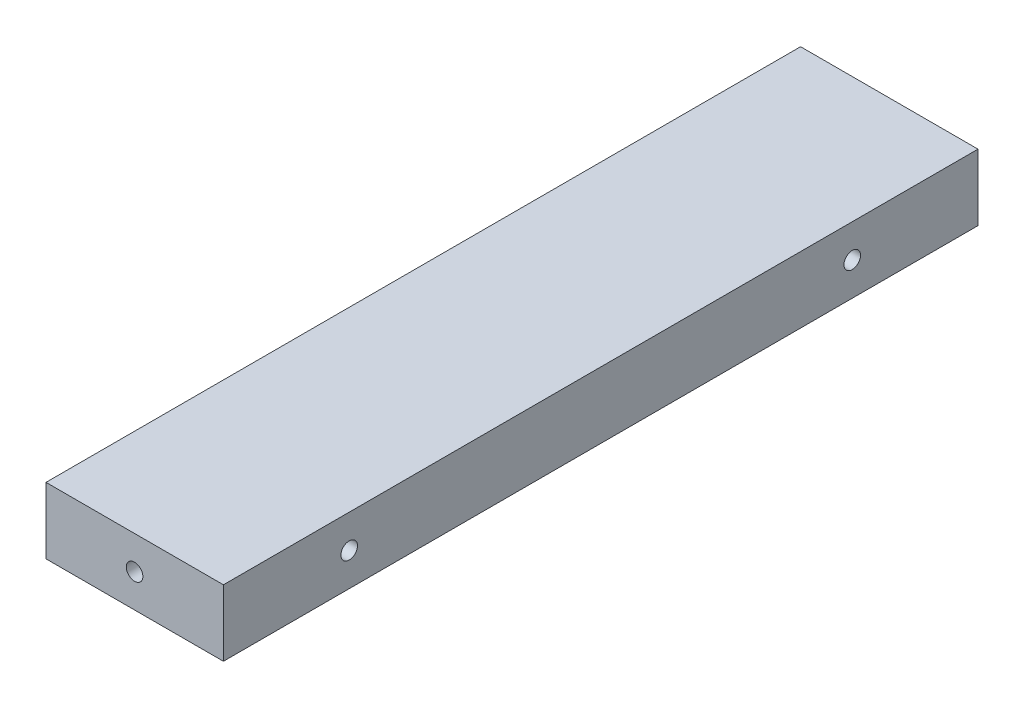
ISO-10303-21;
HEADER;
FILE_DESCRIPTION(('STEP AP214'),'2;1');
FILE_NAME('part.step','',(''),(''),'','','');
FILE_SCHEMA(('AUTOMOTIVE_DESIGN { 1 0 10303 214 1 1 1 1 }'));
ENDSEC;
DATA;
#1=APPLICATION_CONTEXT('core data for automotive mechanical design processes');
#2=APPLICATION_PROTOCOL_DEFINITION('international standard','automotive_design',2000,#1);
#3=PRODUCT_CONTEXT('',#1,'mechanical');
#4=PRODUCT('Part','Part','',(#3));
#5=PRODUCT_RELATED_PRODUCT_CATEGORY('part','',(#4));
#6=PRODUCT_DEFINITION_FORMATION('','',#4);
#7=PRODUCT_DEFINITION_CONTEXT('part definition',#1,'design');
#8=PRODUCT_DEFINITION('design','',#6,#7);
#9=PRODUCT_DEFINITION_SHAPE('','',#8);
#10=(LENGTH_UNIT() NAMED_UNIT(*) SI_UNIT(.MILLI.,.METRE.));
#11=(NAMED_UNIT(*) PLANE_ANGLE_UNIT() SI_UNIT($,.RADIAN.));
#12=(NAMED_UNIT(*) SI_UNIT($,.STERADIAN.) SOLID_ANGLE_UNIT());
#13=UNCERTAINTY_MEASURE_WITH_UNIT(LENGTH_MEASURE(1.E-05),#10,'distance_accuracy_value','');
#14=(GEOMETRIC_REPRESENTATION_CONTEXT(3) GLOBAL_UNCERTAINTY_ASSIGNED_CONTEXT((#13)) GLOBAL_UNIT_ASSIGNED_CONTEXT((#10,
#11,#12)) REPRESENTATION_CONTEXT('',''));
#15=CARTESIAN_POINT('',(0.,0.,0.));
#16=DIRECTION('',(0.,0.,1.));
#17=DIRECTION('',(1.,0.,0.));
#18=AXIS2_PLACEMENT_3D('',#15,#16,#17);
#19=CARTESIAN_POINT('',(0.,0.,0.));
#20=DIRECTION('',(0.,0.,1.00000000000006));
#21=DIRECTION('',(1.00000000000002,0.,0.));
#22=AXIS2_PLACEMENT_3D('',#19,#20,#21);
#23=PLANE('',#22);
#24=DIRECTION('',(0.,-1.,0.));
#25=VECTOR('',#24,1.);
#26=CARTESIAN_POINT('',(-40.0809208496687,-119.999999994001,-1.55431223447522E-12));
#27=LINE('',#26,#25);
#28=CARTESIAN_POINT('',(-40.0809208496687,-119.999999994001,-1.55431223447522E-12));
#29=VERTEX_POINT('',#28);
#30=CARTESIAN_POINT('',(-40.0809208496694,-132.699999993998,-9.99200722162641E-13));
#31=VERTEX_POINT('',#30);
#32=EDGE_CURVE('E121',#29,#31,#27,.T.);
#33=ORIENTED_EDGE('',*,*,#32,.F.);
#34=DIRECTION('',(-1.00000000000002,0.,0.));
#35=VECTOR('',#34,1.);
#36=CARTESIAN_POINT('',(-40.0809208496687,-119.999999994001,-1.55431223447522E-12));
#37=LINE('',#36,#35);
#38=CARTESIAN_POINT('',(-6.08092084966791,-119.999999994001,2.22044604925031E-13));
#39=VERTEX_POINT('',#38);
#40=EDGE_CURVE('E130',#39,#29,#37,.T.);
#41=ORIENTED_EDGE('',*,*,#40,.F.);
#42=DIRECTION('',(0.,1.,0.));
#43=VECTOR('',#42,1.);
#44=CARTESIAN_POINT('',(-6.08092084966791,-119.999999994001,2.22044604925031E-13));
#45=LINE('',#44,#43);
#46=CARTESIAN_POINT('',(-6.08092084966794,-132.699999993998,-3.36536354339501E-13));
#47=VERTEX_POINT('',#46);
#48=EDGE_CURVE('E127',#47,#39,#45,.T.);
#49=ORIENTED_EDGE('',*,*,#48,.F.);
#50=DIRECTION('',(1.00000000000002,0.,0.));
#51=VECTOR('',#50,1.);
#52=CARTESIAN_POINT('',(-40.0809208496694,-132.699999993998,-9.99200722162641E-13));
#53=LINE('',#52,#51);
#54=EDGE_CURVE('E124',#31,#47,#53,.T.);
#55=ORIENTED_EDGE('',*,*,#54,.F.);
#56=EDGE_LOOP('',(#33,#41,#49,#55));
#57=FACE_BOUND('',#56,.T.);
#58=ADVANCED_FACE('F36',(#57),#23,.F.);
#59=CARTESIAN_POINT('',(-40.08092084967,-119.999999994002,180.894489939946));
#60=DIRECTION('',(0.,-1.,0.));
#61=DIRECTION('',(0.,0.,-1.00000000000006));
#62=AXIS2_PLACEMENT_3D('',#59,#60,#61);
#63=PLANE('',#62);
#64=DIRECTION('',(0.,0.,-1.00000000000006));
#65=VECTOR('',#64,1.);
#66=CARTESIAN_POINT('',(-40.08092084967,-119.999999994002,180.894489939946));
#67=LINE('',#66,#65);
#68=CARTESIAN_POINT('',(-40.0809208496701,-119.999999994,144.600000000009));
#69=VERTEX_POINT('',#68);
#70=EDGE_CURVE('E133',#69,#29,#67,.T.);
#71=ORIENTED_EDGE('',*,*,#70,.F.);
#72=DIRECTION('',(1.00000000000002,0.,0.));
#73=VECTOR('',#72,1.);
#74=CARTESIAN_POINT('',(-40.0809208496701,-119.999999994,144.600000000009));
#75=LINE('',#74,#73);
#76=CARTESIAN_POINT('',(-6.08092084966969,-119.999999994,144.60000000001));
#77=VERTEX_POINT('',#76);
#78=EDGE_CURVE('E57',#69,#77,#75,.T.);
#79=ORIENTED_EDGE('',*,*,#78,.T.);
#80=DIRECTION('',(0.,0.,-1.00000000000006));
#81=VECTOR('',#80,1.);
#82=CARTESIAN_POINT('',(-6.08092084966982,-119.999999994001,180.894489939946));
#83=LINE('',#82,#81);
#84=EDGE_CURVE('E135',#77,#39,#83,.T.);
#85=ORIENTED_EDGE('',*,*,#84,.T.);
#86=ORIENTED_EDGE('',*,*,#40,.T.);
#87=EDGE_LOOP('',(#71,#79,#85,#86));
#88=FACE_BOUND('',#87,.T.);
#89=ADVANCED_FACE('F169',(#88),#63,.F.);
#90=CARTESIAN_POINT('',(-6.08092084966982,-119.999999994001,180.894489939946));
#91=DIRECTION('',(-1.00000000000002,0.,0.));
#92=DIRECTION('',(0.,0.,1.00000000000006));
#93=AXIS2_PLACEMENT_3D('',#90,#91,#92);
#94=PLANE('',#93);
#95=CARTESIAN_POINT('',(-6.08092084966924,-126.349999993998,120.500000000007));
#96=DIRECTION('',(-1.00000000000002,0.,0.));
#97=DIRECTION('',(0.,0.,1.00000000000006));
#98=AXIS2_PLACEMENT_3D('',#95,#96,#97);
#99=CIRCLE('',#98,1.5875);
#100=CARTESIAN_POINT('',(-6.08092084966925,-126.349999993998,122.087500000007));
#101=VERTEX_POINT('',#100);
#102=EDGE_CURVE('E112',#101,#101,#99,.T.);
#103=ORIENTED_EDGE('',*,*,#102,.T.);
#104=EDGE_LOOP('',(#103));
#105=FACE_BOUND('',#104,.T.);
#106=CARTESIAN_POINT('',(-6.08092084966916,-126.349999993998,24.1000000000003));
#107=DIRECTION('',(-1.00000000000002,0.,0.));
#108=DIRECTION('',(0.,0.,1.00000000000006));
#109=AXIS2_PLACEMENT_3D('',#106,#107,#108);
#110=CIRCLE('',#109,1.5875);
#111=CARTESIAN_POINT('',(-6.08092084966916,-126.349999993998,25.6875000000004));
#112=VERTEX_POINT('',#111);
#113=EDGE_CURVE('E116',#112,#112,#110,.T.);
#114=ORIENTED_EDGE('',*,*,#113,.T.);
#115=EDGE_LOOP('',(#114));
#116=FACE_BOUND('',#115,.T.);
#117=ORIENTED_EDGE('',*,*,#84,.F.);
#118=DIRECTION('',(0.,-1.,0.));
#119=VECTOR('',#118,1.);
#120=CARTESIAN_POINT('',(-6.08092084966969,-119.999999994,144.60000000001));
#121=LINE('',#120,#119);
#122=CARTESIAN_POINT('',(-6.08092084966963,-132.699999993998,144.600000000009));
#123=VERTEX_POINT('',#122);
#124=EDGE_CURVE('E117',#77,#123,#121,.T.);
#125=ORIENTED_EDGE('',*,*,#124,.T.);
#126=DIRECTION('',(0.,0.,-1.00000000000006));
#127=VECTOR('',#126,1.);
#128=CARTESIAN_POINT('',(-6.08092084966966,-132.699999993998,180.894489939946));
#129=LINE('',#128,#127);
#130=EDGE_CURVE('E137',#123,#47,#129,.T.);
#131=ORIENTED_EDGE('',*,*,#130,.T.);
#132=ORIENTED_EDGE('',*,*,#48,.T.);
#133=EDGE_LOOP('',(#117,#125,#131,#132));
#134=FACE_BOUND('',#133,.T.);
#135=ADVANCED_FACE('F175',(#105,#116,#134),#94,.F.);
#136=CARTESIAN_POINT('',(-40.0809208496708,-132.699999993998,180.894489939946));
#137=DIRECTION('',(0.,1.,0.));
#138=DIRECTION('',(0.,0.,1.00000000000006));
#139=AXIS2_PLACEMENT_3D('',#136,#137,#138);
#140=PLANE('',#139);
#141=ORIENTED_EDGE('',*,*,#130,.F.);
#142=DIRECTION('',(-1.00000000000002,0.,0.));
#143=VECTOR('',#142,1.);
#144=CARTESIAN_POINT('',(-40.0809208496703,-132.699999993998,144.600000000009));
#145=LINE('',#144,#143);
#146=CARTESIAN_POINT('',(-40.0809208496703,-132.699999993998,144.600000000009));
#147=VERTEX_POINT('',#146);
#148=EDGE_CURVE('E45',#123,#147,#145,.T.);
#149=ORIENTED_EDGE('',*,*,#148,.T.);
#150=DIRECTION('',(0.,0.,-1.00000000000006));
#151=VECTOR('',#150,1.);
#152=CARTESIAN_POINT('',(-40.0809208496708,-132.699999993998,180.894489939946));
#153=LINE('',#152,#151);
#154=EDGE_CURVE('E139',#147,#31,#153,.T.);
#155=ORIENTED_EDGE('',*,*,#154,.T.);
#156=ORIENTED_EDGE('',*,*,#54,.T.);
#157=EDGE_LOOP('',(#141,#149,#155,#156));
#158=FACE_BOUND('',#157,.T.);
#159=ADVANCED_FACE('F184',(#158),#140,.F.);
#160=CARTESIAN_POINT('',(-40.08092084967,-119.999999994002,180.894489939946));
#161=DIRECTION('',(1.00000000000002,0.,0.));
#162=DIRECTION('',(0.,0.,-1.00000000000006));
#163=AXIS2_PLACEMENT_3D('',#160,#161,#162);
#164=PLANE('',#163);
#165=CARTESIAN_POINT('',(-40.0809208496699,-126.349999994,48.2000000000016));
#166=DIRECTION('',(1.00000000000002,0.,0.));
#167=DIRECTION('',(0.,0.,-1.00000000000006));
#168=AXIS2_PLACEMENT_3D('',#165,#166,#167);
#169=CIRCLE('',#168,1.5875);
#170=CARTESIAN_POINT('',(-40.0809208496699,-126.349999994,46.6125000000015));
#171=VERTEX_POINT('',#170);
#172=EDGE_CURVE('E40',#171,#171,#169,.T.);
#173=ORIENTED_EDGE('',*,*,#172,.T.);
#174=EDGE_LOOP('',(#173));
#175=FACE_BOUND('',#174,.T.);
#176=CARTESIAN_POINT('',(-40.0809208496693,-126.349999994003,96.4000000000043));
#177=DIRECTION('',(1.00000000000002,0.,0.));
#178=DIRECTION('',(0.,0.,-1.00000000000006));
#179=AXIS2_PLACEMENT_3D('',#176,#177,#178);
#180=CIRCLE('',#179,1.5875);
#181=CARTESIAN_POINT('',(-40.0809208496693,-126.349999994003,94.8125000000042));
#182=VERTEX_POINT('',#181);
#183=EDGE_CURVE('E104',#182,#182,#180,.T.);
#184=ORIENTED_EDGE('',*,*,#183,.T.);
#185=EDGE_LOOP('',(#184));
#186=FACE_BOUND('',#185,.T.);
#187=ORIENTED_EDGE('',*,*,#154,.F.);
#188=DIRECTION('',(0.,1.,0.));
#189=VECTOR('',#188,1.);
#190=CARTESIAN_POINT('',(-40.0809208496701,-119.999999994,144.600000000009));
#191=LINE('',#190,#189);
#192=EDGE_CURVE('E11',#147,#69,#191,.T.);
#193=ORIENTED_EDGE('',*,*,#192,.T.);
#194=ORIENTED_EDGE('',*,*,#70,.T.);
#195=ORIENTED_EDGE('',*,*,#32,.T.);
#196=EDGE_LOOP('',(#187,#193,#194,#195));
#197=FACE_BOUND('',#196,.T.);
#198=ADVANCED_FACE('F38',(#175,#186,#197),#164,.F.);
#199=CARTESIAN_POINT('',(12.9190791503297,124.004465969194,144.600000000009));
#200=DIRECTION('',(0.,0.,-1.00000000000006));
#201=DIRECTION('',(0.,1.,0.));
#202=AXIS2_PLACEMENT_3D('',#199,#200,#201);
#203=PLANE('',#202);
#204=CARTESIAN_POINT('',(-23.1059208496702,-126.349999994,144.600000000009));
#205=DIRECTION('',(0.,0.,-1.00000000000006));
#206=DIRECTION('',(-1.00000000000002,0.,0.));
#207=AXIS2_PLACEMENT_3D('',#204,#205,#206);
#208=CIRCLE('',#207,1.58750000000003);
#209=CARTESIAN_POINT('',(-24.6934208496703,-126.349999994,144.600000000009));
#210=VERTEX_POINT('',#209);
#211=EDGE_CURVE('E108',#210,#210,#208,.T.);
#212=ORIENTED_EDGE('',*,*,#211,.T.);
#213=EDGE_LOOP('',(#212));
#214=FACE_BOUND('',#213,.T.);
#215=ORIENTED_EDGE('',*,*,#148,.F.);
#216=ORIENTED_EDGE('',*,*,#124,.F.);
#217=ORIENTED_EDGE('',*,*,#78,.F.);
#218=ORIENTED_EDGE('',*,*,#192,.F.);
#219=EDGE_LOOP('',(#215,#216,#217,#218));
#220=FACE_BOUND('',#219,.T.);
#221=ADVANCED_FACE('F180',(#214,#220),#203,.F.);
#222=CARTESIAN_POINT('',(12.9190791503307,-126.349999994,24.1000000000001));
#223=DIRECTION('',(1.00000000000002,0.,0.));
#224=DIRECTION('',(0.,0.,-1.00000000000006));
#225=AXIS2_PLACEMENT_3D('',#222,#223,#224);
#226=CYLINDRICAL_SURFACE('',#225,1.5875);
#227=CARTESIAN_POINT('',(-18.8309208496698,-126.349999993998,24.1000000000004));
#228=DIRECTION('',(1.00000000000002,0.,0.));
#229=DIRECTION('',(0.,0.,-1.00000000000006));
#230=AXIS2_PLACEMENT_3D('',#227,#228,#229);
#231=CIRCLE('',#230,1.58749999999999);
#232=CARTESIAN_POINT('',(-18.8309208496697,-126.349999993998,22.5125000000003));
#233=VERTEX_POINT('',#232);
#234=EDGE_CURVE('E113',#233,#233,#231,.T.);
#235=ORIENTED_EDGE('',*,*,#234,.F.);
#236=EDGE_LOOP('',(#235));
#237=FACE_BOUND('',#236,.T.);
#238=ORIENTED_EDGE('',*,*,#113,.F.);
#239=EDGE_LOOP('',(#238));
#240=FACE_BOUND('',#239,.T.);
#241=ADVANCED_FACE('F197',(#237,#240),#226,.F.);
#242=CARTESIAN_POINT('',(-18.8309208496698,-126.349999993998,24.1000000000004));
#243=DIRECTION('',(1.00000000000002,0.,0.));
#244=DIRECTION('',(0.,0.,-1.00000000000006));
#245=AXIS2_PLACEMENT_3D('',#242,#243,#244);
#246=CONICAL_SURFACE('',#245,1.58749999999999,1.02974425867665);
#247=CARTESIAN_POINT('',(-19.7847870823764,-126.349999994,24.1000000000002));
#248=VERTEX_POINT('',#247);
#249=VERTEX_LOOP('',#248);
#250=FACE_BOUND('',#249,.T.);
#251=ORIENTED_EDGE('',*,*,#234,.T.);
#252=EDGE_LOOP('',(#251));
#253=FACE_BOUND('',#252,.T.);
#254=ADVANCED_FACE('F202',(#250,#253),#246,.F.);
#255=CARTESIAN_POINT('',(12.9190791503299,-126.349999994,120.500000000007));
#256=DIRECTION('',(1.00000000000002,0.,0.));
#257=DIRECTION('',(0.,0.,-1.00000000000006));
#258=AXIS2_PLACEMENT_3D('',#255,#256,#257);
#259=CYLINDRICAL_SURFACE('',#258,1.5875);
#260=CARTESIAN_POINT('',(-18.8309208496704,-126.349999993998,120.500000000007));
#261=DIRECTION('',(1.00000000000002,0.,0.));
#262=DIRECTION('',(0.,0.,-1.00000000000006));
#263=AXIS2_PLACEMENT_3D('',#260,#261,#262);
#264=CIRCLE('',#263,1.58749999999999);
#265=CARTESIAN_POINT('',(-18.8309208496704,-126.349999993998,118.912500000007));
#266=VERTEX_POINT('',#265);
#267=EDGE_CURVE('E109',#266,#266,#264,.T.);
#268=ORIENTED_EDGE('',*,*,#267,.F.);
#269=EDGE_LOOP('',(#268));
#270=FACE_BOUND('',#269,.T.);
#271=ORIENTED_EDGE('',*,*,#102,.F.);
#272=EDGE_LOOP('',(#271));
#273=FACE_BOUND('',#272,.T.);
#274=ADVANCED_FACE('F214',(#270,#273),#259,.F.);
#275=CARTESIAN_POINT('',(-18.8309208496704,-126.349999993998,120.500000000007));
#276=DIRECTION('',(1.00000000000002,0.,0.));
#277=DIRECTION('',(0.,0.,-1.00000000000006));
#278=AXIS2_PLACEMENT_3D('',#275,#276,#277);
#279=CONICAL_SURFACE('',#278,1.58749999999999,1.02974425867665);
#280=CARTESIAN_POINT('',(-19.7847870823771,-126.349999993998,120.500000000007));
#281=VERTEX_POINT('',#280);
#282=VERTEX_LOOP('',#281);
#283=FACE_BOUND('',#282,.T.);
#284=ORIENTED_EDGE('',*,*,#267,.T.);
#285=EDGE_LOOP('',(#284));
#286=FACE_BOUND('',#285,.T.);
#287=ADVANCED_FACE('F208',(#283,#286),#279,.F.);
#288=CARTESIAN_POINT('',(-23.1059208496696,-126.349999994,157.30000000001));
#289=DIRECTION('',(0.,0.,1.00000000000006));
#290=DIRECTION('',(1.00000000000002,0.,0.));
#291=AXIS2_PLACEMENT_3D('',#288,#289,#290);
#292=CYLINDRICAL_SURFACE('',#291,1.58750000000003);
#293=CARTESIAN_POINT('',(-23.1059208496693,-126.349999994,125.550000000009));
#294=DIRECTION('',(0.,0.,1.00000000000006));
#295=DIRECTION('',(1.00000000000002,0.,0.));
#296=AXIS2_PLACEMENT_3D('',#293,#294,#295);
#297=CIRCLE('',#296,1.5875);
#298=CARTESIAN_POINT('',(-21.5184208496693,-126.349999994,125.550000000009));
#299=VERTEX_POINT('',#298);
#300=EDGE_CURVE('E105',#299,#299,#297,.T.);
#301=ORIENTED_EDGE('',*,*,#300,.F.);
#302=EDGE_LOOP('',(#301));
#303=FACE_BOUND('',#302,.T.);
#304=ORIENTED_EDGE('',*,*,#211,.F.);
#305=EDGE_LOOP('',(#304));
#306=FACE_BOUND('',#305,.T.);
#307=ADVANCED_FACE('F164',(#303,#306),#292,.F.);
#308=CARTESIAN_POINT('',(-23.1059208496693,-126.349999994,125.550000000009));
#309=DIRECTION('',(0.,0.,1.00000000000006));
#310=DIRECTION('',(1.00000000000002,0.,0.));
#311=AXIS2_PLACEMENT_3D('',#308,#309,#310);
#312=CONICAL_SURFACE('',#311,1.5875,1.02974425867666);
#313=CARTESIAN_POINT('',(-23.1059208496699,-126.349999994,124.596133767301));
#314=VERTEX_POINT('',#313);
#315=VERTEX_LOOP('',#314);
#316=FACE_BOUND('',#315,.T.);
#317=ORIENTED_EDGE('',*,*,#300,.T.);
#318=EDGE_LOOP('',(#317));
#319=FACE_BOUND('',#318,.T.);
#320=ADVANCED_FACE('F155',(#316,#319),#312,.F.);
#321=CARTESIAN_POINT('',(-52.7809208496698,-126.349999994003,96.4000000000048));
#322=DIRECTION('',(-1.00000000000002,0.,0.));
#323=DIRECTION('',(0.,0.,1.00000000000006));
#324=AXIS2_PLACEMENT_3D('',#321,#322,#323);
#325=CYLINDRICAL_SURFACE('',#324,1.5875);
#326=CARTESIAN_POINT('',(-21.0309208496696,-126.349999994003,96.4000000000049));
#327=DIRECTION('',(-1.00000000000002,0.,0.));
#328=DIRECTION('',(0.,0.,1.00000000000006));
#329=AXIS2_PLACEMENT_3D('',#326,#327,#328);
#330=CIRCLE('',#329,1.58749999999999);
#331=CARTESIAN_POINT('',(-21.0309208496696,-126.349999994003,97.9875000000049));
#332=VERTEX_POINT('',#331);
#333=EDGE_CURVE('E100',#332,#332,#330,.T.);
#334=ORIENTED_EDGE('',*,*,#333,.F.);
#335=EDGE_LOOP('',(#334));
#336=FACE_BOUND('',#335,.T.);
#337=ORIENTED_EDGE('',*,*,#183,.F.);
#338=EDGE_LOOP('',(#337));
#339=FACE_BOUND('',#338,.T.);
#340=ADVANCED_FACE('F152',(#336,#339),#325,.F.);
#341=CARTESIAN_POINT('',(-21.0309208496696,-126.349999994003,96.4000000000049));
#342=DIRECTION('',(-1.00000000000002,0.,0.));
#343=DIRECTION('',(0.,0.,1.00000000000006));
#344=AXIS2_PLACEMENT_3D('',#341,#342,#343);
#345=CONICAL_SURFACE('',#344,1.58749999999999,1.02974425867665);
#346=CARTESIAN_POINT('',(-20.0770546169634,-126.349999994003,96.4000000000046));
#347=VERTEX_POINT('',#346);
#348=VERTEX_LOOP('',#347);
#349=FACE_BOUND('',#348,.T.);
#350=ORIENTED_EDGE('',*,*,#333,.T.);
#351=EDGE_LOOP('',(#350));
#352=FACE_BOUND('',#351,.T.);
#353=ADVANCED_FACE('F154',(#349,#352),#345,.F.);
#354=CARTESIAN_POINT('',(-52.7809208496699,-126.349999993998,48.2000000000017));
#355=DIRECTION('',(-1.00000000000002,0.,0.));
#356=DIRECTION('',(0.,0.,1.00000000000006));
#357=AXIS2_PLACEMENT_3D('',#354,#355,#356);
#358=CYLINDRICAL_SURFACE('',#357,1.5875);
#359=CARTESIAN_POINT('',(-21.030920849669,-126.349999994,48.2000000000014));
#360=DIRECTION('',(-1.00000000000002,0.,0.));
#361=DIRECTION('',(0.,0.,1.00000000000006));
#362=AXIS2_PLACEMENT_3D('',#359,#360,#361);
#363=CIRCLE('',#362,1.58749999999999);
#364=CARTESIAN_POINT('',(-21.030920849669,-126.349999994,49.7875000000015));
#365=VERTEX_POINT('',#364);
#366=EDGE_CURVE('E96',#365,#365,#363,.T.);
#367=ORIENTED_EDGE('',*,*,#366,.F.);
#368=EDGE_LOOP('',(#367));
#369=FACE_BOUND('',#368,.T.);
#370=ORIENTED_EDGE('',*,*,#172,.F.);
#371=EDGE_LOOP('',(#370));
#372=FACE_BOUND('',#371,.T.);
#373=ADVANCED_FACE('F92',(#369,#372),#358,.F.);
#374=CARTESIAN_POINT('',(-21.030920849669,-126.349999994,48.2000000000014));
#375=DIRECTION('',(-1.00000000000002,0.,0.));
#376=DIRECTION('',(0.,0.,1.00000000000006));
#377=AXIS2_PLACEMENT_3D('',#374,#375,#376);
#378=CONICAL_SURFACE('',#377,1.58749999999999,1.02974425867665);
#379=CARTESIAN_POINT('',(-20.0770546169636,-126.349999994,48.2000000000019));
#380=VERTEX_POINT('',#379);
#381=VERTEX_LOOP('',#380);
#382=FACE_BOUND('',#381,.T.);
#383=ORIENTED_EDGE('',*,*,#366,.T.);
#384=EDGE_LOOP('',(#383));
#385=FACE_BOUND('',#384,.T.);
#386=ADVANCED_FACE('F89',(#382,#385),#378,.F.);
#387=CLOSED_SHELL('',(#58,#89,#135,#159,#198,#221,#241,#254,#274,#287,#307,#320,#340,#353,#373,#386));
#388=MANIFOLD_SOLID_BREP('B2',#387);
#389=ADVANCED_BREP_SHAPE_REPRESENTATION('',(#18,#388),#14);
#390=SHAPE_DEFINITION_REPRESENTATION(#9,#389);
ENDSEC;
END-ISO-10303-21;
